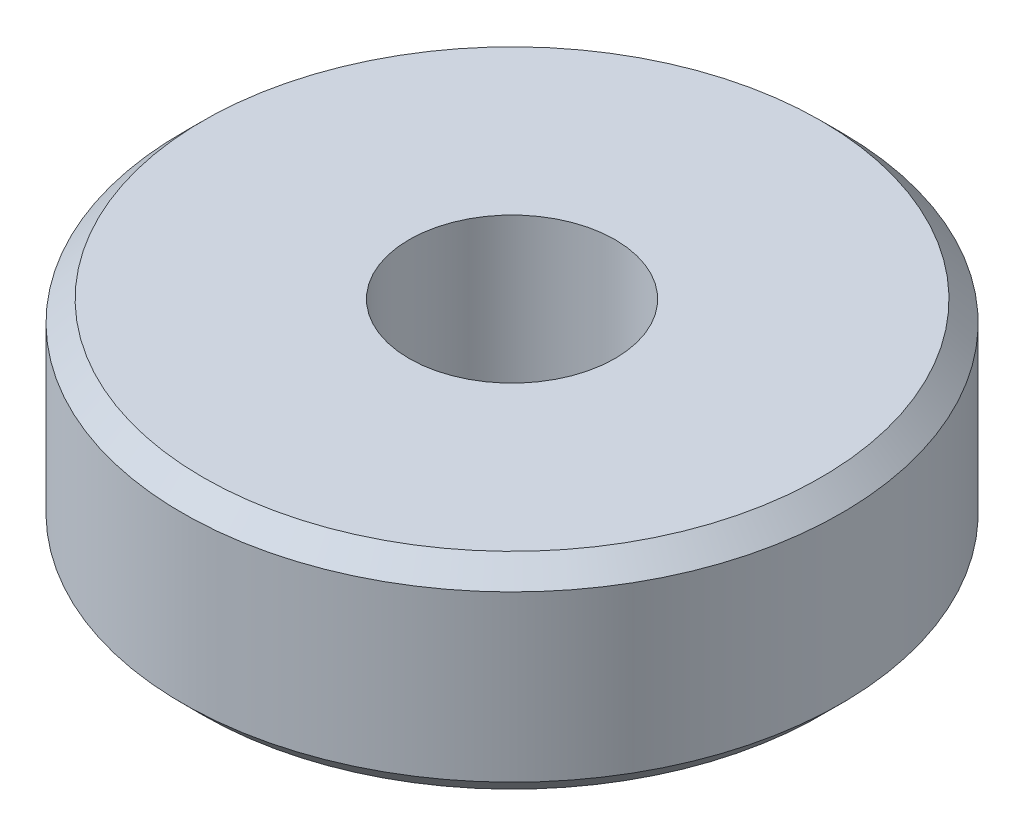
ISO-10303-21;
HEADER;
FILE_DESCRIPTION(('STEP AP214'),'2;1');
FILE_NAME('part.step','',(''),(''),'','','');
FILE_SCHEMA(('AUTOMOTIVE_DESIGN { 1 0 10303 214 1 1 1 1 }'));
ENDSEC;
DATA;
#1=APPLICATION_CONTEXT('core data for automotive mechanical design processes');
#2=APPLICATION_PROTOCOL_DEFINITION('international standard','automotive_design',2000,#1);
#3=PRODUCT_CONTEXT('',#1,'mechanical');
#4=PRODUCT('Part','Part','',(#3));
#5=PRODUCT_RELATED_PRODUCT_CATEGORY('part','',(#4));
#6=PRODUCT_DEFINITION_FORMATION('','',#4);
#7=PRODUCT_DEFINITION_CONTEXT('part definition',#1,'design');
#8=PRODUCT_DEFINITION('design','',#6,#7);
#9=PRODUCT_DEFINITION_SHAPE('','',#8);
#10=(LENGTH_UNIT() NAMED_UNIT(*) SI_UNIT(.MILLI.,.METRE.));
#11=(NAMED_UNIT(*) PLANE_ANGLE_UNIT() SI_UNIT($,.RADIAN.));
#12=(NAMED_UNIT(*) SI_UNIT($,.STERADIAN.) SOLID_ANGLE_UNIT());
#13=UNCERTAINTY_MEASURE_WITH_UNIT(LENGTH_MEASURE(1.E-05),#10,'distance_accuracy_value','');
#14=(GEOMETRIC_REPRESENTATION_CONTEXT(3) GLOBAL_UNCERTAINTY_ASSIGNED_CONTEXT((#13)) GLOBAL_UNIT_ASSIGNED_CONTEXT((#10,
#11,#12)) REPRESENTATION_CONTEXT('',''));
#15=CARTESIAN_POINT('',(0.,0.,0.));
#16=DIRECTION('',(0.,0.,1.));
#17=DIRECTION('',(1.,0.,0.));
#18=AXIS2_PLACEMENT_3D('',#15,#16,#17);
#19=CARTESIAN_POINT('',(0.,0.,0.));
#20=DIRECTION('',(0.,-1.,0.));
#21=DIRECTION('',(0.,0.,-1.));
#22=AXIS2_PLACEMENT_3D('',#19,#20,#21);
#23=CYLINDRICAL_SURFACE('',#22,2.5);
#24=CARTESIAN_POINT('',(0.,0.,0.));
#25=DIRECTION('',(0.,-1.,0.));
#26=DIRECTION('',(0.,0.,-1.));
#27=AXIS2_PLACEMENT_3D('',#24,#25,#26);
#28=CIRCLE('',#27,2.5);
#29=CARTESIAN_POINT('',(0.,0.,-2.5));
#30=VERTEX_POINT('',#29);
#31=EDGE_CURVE('E53',#30,#30,#28,.T.);
#32=ORIENTED_EDGE('',*,*,#31,.T.);
#33=EDGE_LOOP('',(#32));
#34=FACE_BOUND('',#33,.T.);
#35=CARTESIAN_POINT('',(0.,5.,0.));
#36=DIRECTION('',(0.,-1.,0.));
#37=DIRECTION('',(0.,0.,-1.));
#38=AXIS2_PLACEMENT_3D('',#35,#36,#37);
#39=CIRCLE('',#38,2.5);
#40=CARTESIAN_POINT('',(0.,5.,-2.5));
#41=VERTEX_POINT('',#40);
#42=EDGE_CURVE('E10',#41,#41,#39,.T.);
#43=ORIENTED_EDGE('',*,*,#42,.F.);
#44=EDGE_LOOP('',(#43));
#45=FACE_BOUND('',#44,.T.);
#46=ADVANCED_FACE('F31',(#34,#45),#23,.F.);
#47=CARTESIAN_POINT('',(2.5,5.,0.));
#48=DIRECTION('',(0.,1.,0.));
#49=DIRECTION('',(0.,0.,1.));
#50=AXIS2_PLACEMENT_3D('',#47,#48,#49);
#51=PLANE('',#50);
#52=ORIENTED_EDGE('',*,*,#42,.T.);
#53=EDGE_LOOP('',(#52));
#54=FACE_BOUND('',#53,.T.);
#55=CARTESIAN_POINT('',(0.,5.,0.));
#56=DIRECTION('',(0.,-1.,0.));
#57=DIRECTION('',(0.,0.,-1.));
#58=AXIS2_PLACEMENT_3D('',#55,#56,#57);
#59=CIRCLE('',#58,7.5);
#60=CARTESIAN_POINT('',(0.,5.,-7.5));
#61=VERTEX_POINT('',#60);
#62=EDGE_CURVE('E37',#61,#61,#59,.T.);
#63=ORIENTED_EDGE('',*,*,#62,.F.);
#64=EDGE_LOOP('',(#63));
#65=FACE_BOUND('',#64,.T.);
#66=ADVANCED_FACE('F71',(#54,#65),#51,.T.);
#67=CARTESIAN_POINT('',(0.,4.5,0.));
#68=DIRECTION('',(0.,-1.,0.));
#69=DIRECTION('',(0.,0.,-1.));
#70=AXIS2_PLACEMENT_3D('',#67,#68,#69);
#71=CONICAL_SURFACE('',#70,8.,0.785398163397449);
#72=ORIENTED_EDGE('',*,*,#62,.T.);
#73=EDGE_LOOP('',(#72));
#74=FACE_BOUND('',#73,.T.);
#75=CARTESIAN_POINT('',(0.,4.5,0.));
#76=DIRECTION('',(0.,-1.,0.));
#77=DIRECTION('',(0.,0.,-1.));
#78=AXIS2_PLACEMENT_3D('',#75,#76,#77);
#79=CIRCLE('',#78,8.);
#80=CARTESIAN_POINT('',(0.,4.5,-8.));
#81=VERTEX_POINT('',#80);
#82=EDGE_CURVE('E41',#81,#81,#79,.T.);
#83=ORIENTED_EDGE('',*,*,#82,.F.);
#84=EDGE_LOOP('',(#83));
#85=FACE_BOUND('',#84,.T.);
#86=ADVANCED_FACE('F75',(#74,#85),#71,.T.);
#87=CARTESIAN_POINT('',(0.,0.,0.));
#88=DIRECTION('',(0.,-1.,0.));
#89=DIRECTION('',(0.,0.,-1.));
#90=AXIS2_PLACEMENT_3D('',#87,#88,#89);
#91=CYLINDRICAL_SURFACE('',#90,8.);
#92=ORIENTED_EDGE('',*,*,#82,.T.);
#93=EDGE_LOOP('',(#92));
#94=FACE_BOUND('',#93,.T.);
#95=CARTESIAN_POINT('',(0.,0.5,0.));
#96=DIRECTION('',(0.,-1.,0.));
#97=DIRECTION('',(0.,0.,-1.));
#98=AXIS2_PLACEMENT_3D('',#95,#96,#97);
#99=CIRCLE('',#98,8.);
#100=CARTESIAN_POINT('',(0.,0.5,-8.));
#101=VERTEX_POINT('',#100);
#102=EDGE_CURVE('E45',#101,#101,#99,.T.);
#103=ORIENTED_EDGE('',*,*,#102,.F.);
#104=EDGE_LOOP('',(#103));
#105=FACE_BOUND('',#104,.T.);
#106=ADVANCED_FACE('F67',(#94,#105),#91,.T.);
#107=CARTESIAN_POINT('',(0.,0.,0.));
#108=DIRECTION('',(0.,1.,0.));
#109=DIRECTION('',(0.,0.,1.));
#110=AXIS2_PLACEMENT_3D('',#107,#108,#109);
#111=CONICAL_SURFACE('',#110,7.5,0.785398163397449);
#112=ORIENTED_EDGE('',*,*,#102,.T.);
#113=EDGE_LOOP('',(#112));
#114=FACE_BOUND('',#113,.T.);
#115=CARTESIAN_POINT('',(0.,0.,0.));
#116=DIRECTION('',(0.,-1.,0.));
#117=DIRECTION('',(0.,0.,-1.));
#118=AXIS2_PLACEMENT_3D('',#115,#116,#117);
#119=CIRCLE('',#118,7.5);
#120=CARTESIAN_POINT('',(0.,0.,-7.5));
#121=VERTEX_POINT('',#120);
#122=EDGE_CURVE('E50',#121,#121,#119,.T.);
#123=ORIENTED_EDGE('',*,*,#122,.F.);
#124=EDGE_LOOP('',(#123));
#125=FACE_BOUND('',#124,.T.);
#126=ADVANCED_FACE('F61',(#114,#125),#111,.T.);
#127=CARTESIAN_POINT('',(2.5,0.,0.));
#128=DIRECTION('',(0.,-1.,0.));
#129=DIRECTION('',(0.,0.,-1.));
#130=AXIS2_PLACEMENT_3D('',#127,#128,#129);
#131=PLANE('',#130);
#132=ORIENTED_EDGE('',*,*,#122,.T.);
#133=EDGE_LOOP('',(#132));
#134=FACE_BOUND('',#133,.T.);
#135=ORIENTED_EDGE('',*,*,#31,.F.);
#136=EDGE_LOOP('',(#135));
#137=FACE_BOUND('',#136,.T.);
#138=ADVANCED_FACE('F59',(#134,#137),#131,.T.);
#139=CLOSED_SHELL('',(#46,#66,#86,#106,#126,#138));
#140=MANIFOLD_SOLID_BREP('B2',#139);
#141=ADVANCED_BREP_SHAPE_REPRESENTATION('',(#18,#140),#14);
#142=SHAPE_DEFINITION_REPRESENTATION(#9,#141);
ENDSEC;
END-ISO-10303-21;
